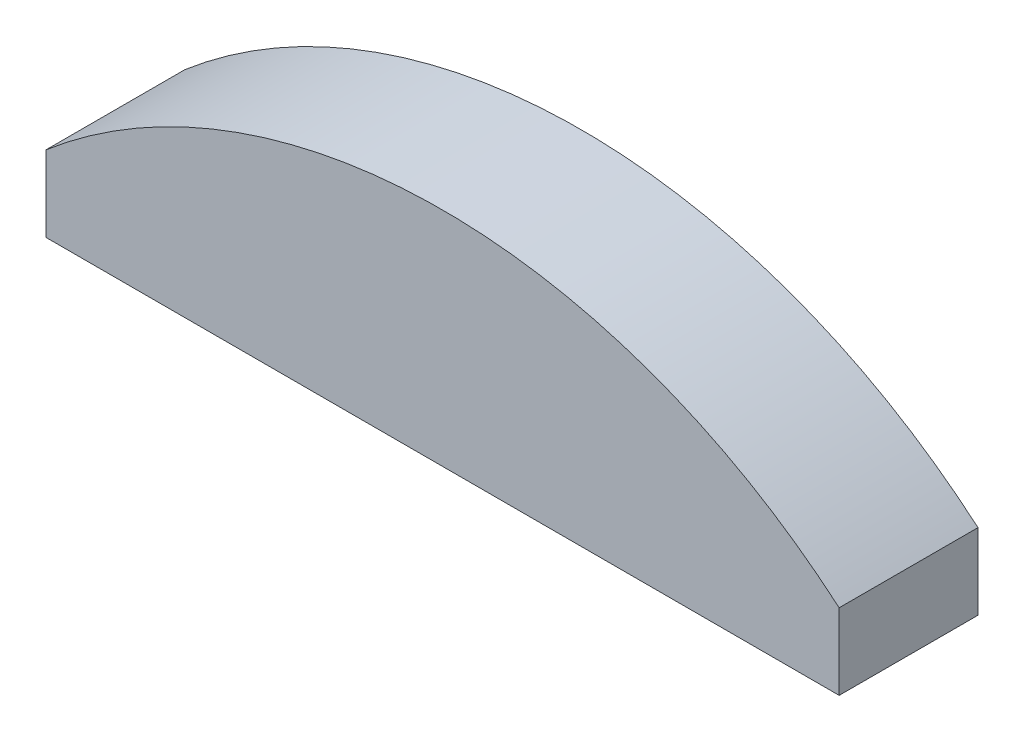
ISO-10303-21;
HEADER;
FILE_DESCRIPTION(('STEP AP214'),'2;1');
FILE_NAME('part.step','',(''),(''),'','','');
FILE_SCHEMA(('AUTOMOTIVE_DESIGN { 1 0 10303 214 1 1 1 1 }'));
ENDSEC;
DATA;
#1=APPLICATION_CONTEXT('core data for automotive mechanical design processes');
#2=APPLICATION_PROTOCOL_DEFINITION('international standard','automotive_design',2000,#1);
#3=PRODUCT_CONTEXT('',#1,'mechanical');
#4=PRODUCT('Part','Part','',(#3));
#5=PRODUCT_RELATED_PRODUCT_CATEGORY('part','',(#4));
#6=PRODUCT_DEFINITION_FORMATION('','',#4);
#7=PRODUCT_DEFINITION_CONTEXT('part definition',#1,'design');
#8=PRODUCT_DEFINITION('design','',#6,#7);
#9=PRODUCT_DEFINITION_SHAPE('','',#8);
#10=(LENGTH_UNIT() NAMED_UNIT(*) SI_UNIT(.MILLI.,.METRE.));
#11=(NAMED_UNIT(*) PLANE_ANGLE_UNIT() SI_UNIT($,.RADIAN.));
#12=(NAMED_UNIT(*) SI_UNIT($,.STERADIAN.) SOLID_ANGLE_UNIT());
#13=UNCERTAINTY_MEASURE_WITH_UNIT(LENGTH_MEASURE(1.E-05),#10,'distance_accuracy_value','');
#14=(GEOMETRIC_REPRESENTATION_CONTEXT(3) GLOBAL_UNCERTAINTY_ASSIGNED_CONTEXT((#13)) GLOBAL_UNIT_ASSIGNED_CONTEXT((#10,
#11,#12)) REPRESENTATION_CONTEXT('',''));
#15=CARTESIAN_POINT('',(0.,0.,0.));
#16=DIRECTION('',(0.,0.,1.));
#17=DIRECTION('',(1.,0.,0.));
#18=AXIS2_PLACEMENT_3D('',#15,#16,#17);
#19=CARTESIAN_POINT('',(-28.5657137141714,28.,5.));
#20=DIRECTION('',(1.,0.,0.));
#21=DIRECTION('',(0.,0.,-1.));
#22=AXIS2_PLACEMENT_3D('',#19,#20,#21);
#23=PLANE('',#22);
#24=DIRECTION('',(0.,-1.,0.));
#25=VECTOR('',#24,1.);
#26=CARTESIAN_POINT('',(-28.5657137141714,28.,-5.));
#27=LINE('',#26,#25);
#28=CARTESIAN_POINT('',(-28.5657137141714,33.4663973584559,-5.));
#29=VERTEX_POINT('',#28);
#30=CARTESIAN_POINT('',(-28.5657137141714,28.,-5.));
#31=VERTEX_POINT('',#30);
#32=EDGE_CURVE('E107',#29,#31,#27,.T.);
#33=ORIENTED_EDGE('',*,*,#32,.T.);
#34=DIRECTION('',(0.,0.,-1.));
#35=VECTOR('',#34,1.);
#36=CARTESIAN_POINT('',(-28.5657137141714,28.,5.));
#37=LINE('',#36,#35);
#38=CARTESIAN_POINT('',(-28.5657137141714,28.,5.));
#39=VERTEX_POINT('',#38);
#40=EDGE_CURVE('E11',#39,#31,#37,.T.);
#41=ORIENTED_EDGE('',*,*,#40,.F.);
#42=DIRECTION('',(0.,-1.,0.));
#43=VECTOR('',#42,1.);
#44=CARTESIAN_POINT('',(-28.5657137141714,28.,5.));
#45=LINE('',#44,#43);
#46=CARTESIAN_POINT('',(-28.5657137141714,33.4663973584559,5.));
#47=VERTEX_POINT('',#46);
#48=EDGE_CURVE('E91',#47,#39,#45,.T.);
#49=ORIENTED_EDGE('',*,*,#48,.F.);
#50=DIRECTION('',(0.,0.,-1.));
#51=VECTOR('',#50,1.);
#52=CARTESIAN_POINT('',(-28.5657137141714,33.4663973584559,5.));
#53=LINE('',#52,#51);
#54=EDGE_CURVE('E103',#47,#29,#53,.T.);
#55=ORIENTED_EDGE('',*,*,#54,.T.);
#56=EDGE_LOOP('',(#33,#41,#49,#55));
#57=FACE_BOUND('',#56,.T.);
#58=ADVANCED_FACE('F39',(#57),#23,.F.);
#59=CARTESIAN_POINT('',(-28.5657137141714,28.,5.));
#60=DIRECTION('',(0.,1.,0.));
#61=DIRECTION('',(0.,0.,1.));
#62=AXIS2_PLACEMENT_3D('',#59,#60,#61);
#63=PLANE('',#62);
#64=DIRECTION('',(1.,0.,0.));
#65=VECTOR('',#64,1.);
#66=CARTESIAN_POINT('',(-28.5657137141714,28.,-5.));
#67=LINE('',#66,#65);
#68=CARTESIAN_POINT('',(28.5657137141714,28.,-5.));
#69=VERTEX_POINT('',#68);
#70=EDGE_CURVE('E96',#31,#69,#67,.T.);
#71=ORIENTED_EDGE('',*,*,#70,.T.);
#72=DIRECTION('',(0.,0.,-1.));
#73=VECTOR('',#72,1.);
#74=CARTESIAN_POINT('',(28.5657137141714,28.,5.));
#75=LINE('',#74,#73);
#76=CARTESIAN_POINT('',(28.5657137141714,28.,5.));
#77=VERTEX_POINT('',#76);
#78=EDGE_CURVE('E48',#77,#69,#75,.T.);
#79=ORIENTED_EDGE('',*,*,#78,.F.);
#80=DIRECTION('',(1.,0.,0.));
#81=VECTOR('',#80,1.);
#82=CARTESIAN_POINT('',(-28.5657137141714,28.,5.));
#83=LINE('',#82,#81);
#84=EDGE_CURVE('E86',#39,#77,#83,.T.);
#85=ORIENTED_EDGE('',*,*,#84,.F.);
#86=ORIENTED_EDGE('',*,*,#40,.T.);
#87=EDGE_LOOP('',(#71,#79,#85,#86));
#88=FACE_BOUND('',#87,.T.);
#89=ADVANCED_FACE('F95',(#88),#63,.F.);
#90=CARTESIAN_POINT('',(28.5657137141714,28.,5.));
#91=DIRECTION('',(-1.,0.,0.));
#92=DIRECTION('',(0.,0.,1.));
#93=AXIS2_PLACEMENT_3D('',#90,#91,#92);
#94=PLANE('',#93);
#95=DIRECTION('',(0.,1.,0.));
#96=VECTOR('',#95,1.);
#97=CARTESIAN_POINT('',(28.5657137141714,28.,-5.));
#98=LINE('',#97,#96);
#99=CARTESIAN_POINT('',(28.5657137141714,33.4663973584559,-5.));
#100=VERTEX_POINT('',#99);
#101=EDGE_CURVE('E73',#69,#100,#98,.T.);
#102=ORIENTED_EDGE('',*,*,#101,.T.);
#103=DIRECTION('',(0.,0.,-1.));
#104=VECTOR('',#103,1.);
#105=CARTESIAN_POINT('',(28.5657137141714,33.4663973584559,5.));
#106=LINE('',#105,#104);
#107=CARTESIAN_POINT('',(28.5657137141714,33.4663973584559,5.));
#108=VERTEX_POINT('',#107);
#109=EDGE_CURVE('E98',#108,#100,#106,.T.);
#110=ORIENTED_EDGE('',*,*,#109,.F.);
#111=DIRECTION('',(0.,1.,0.));
#112=VECTOR('',#111,1.);
#113=CARTESIAN_POINT('',(28.5657137141714,28.,5.));
#114=LINE('',#113,#112);
#115=EDGE_CURVE('E89',#77,#108,#114,.T.);
#116=ORIENTED_EDGE('',*,*,#115,.F.);
#117=ORIENTED_EDGE('',*,*,#78,.T.);
#118=EDGE_LOOP('',(#102,#110,#116,#117));
#119=FACE_BOUND('',#118,.T.);
#120=ADVANCED_FACE('F99',(#119),#94,.F.);
#121=CARTESIAN_POINT('',(0.,0.,5.));
#122=DIRECTION('',(0.,0.,-1.));
#123=DIRECTION('',(-1.,0.,0.));
#124=AXIS2_PLACEMENT_3D('',#121,#122,#123);
#125=CYLINDRICAL_SURFACE('',#124,43.9999971835688);
#126=CARTESIAN_POINT('',(0.,0.,-5.));
#127=DIRECTION('',(0.,0.,1.));
#128=DIRECTION('',(1.,0.,0.));
#129=AXIS2_PLACEMENT_3D('',#126,#127,#128);
#130=CIRCLE('',#129,43.9999971835688);
#131=EDGE_CURVE('E79',#100,#29,#130,.T.);
#132=ORIENTED_EDGE('',*,*,#131,.T.);
#133=ORIENTED_EDGE('',*,*,#54,.F.);
#134=CARTESIAN_POINT('',(0.,0.,5.));
#135=DIRECTION('',(0.,0.,1.));
#136=DIRECTION('',(1.,0.,0.));
#137=AXIS2_PLACEMENT_3D('',#134,#135,#136);
#138=CIRCLE('',#137,43.9999971835688);
#139=EDGE_CURVE('E56',#108,#47,#138,.T.);
#140=ORIENTED_EDGE('',*,*,#139,.F.);
#141=ORIENTED_EDGE('',*,*,#109,.T.);
#142=EDGE_LOOP('',(#132,#133,#140,#141));
#143=FACE_BOUND('',#142,.T.);
#144=ADVANCED_FACE('F120',(#143),#125,.T.);
#145=CARTESIAN_POINT('',(0.,0.,5.));
#146=DIRECTION('',(0.,0.,1.));
#147=DIRECTION('',(1.,0.,0.));
#148=AXIS2_PLACEMENT_3D('',#145,#146,#147);
#149=PLANE('',#148);
#150=ORIENTED_EDGE('',*,*,#48,.T.);
#151=ORIENTED_EDGE('',*,*,#84,.T.);
#152=ORIENTED_EDGE('',*,*,#115,.T.);
#153=ORIENTED_EDGE('',*,*,#139,.T.);
#154=EDGE_LOOP('',(#150,#151,#152,#153));
#155=FACE_BOUND('',#154,.T.);
#156=ADVANCED_FACE('F87',(#155),#149,.T.);
#157=CARTESIAN_POINT('',(0.,0.,-5.));
#158=DIRECTION('',(0.,0.,1.));
#159=DIRECTION('',(1.,0.,0.));
#160=AXIS2_PLACEMENT_3D('',#157,#158,#159);
#161=PLANE('',#160);
#162=ORIENTED_EDGE('',*,*,#32,.F.);
#163=ORIENTED_EDGE('',*,*,#131,.F.);
#164=ORIENTED_EDGE('',*,*,#101,.F.);
#165=ORIENTED_EDGE('',*,*,#70,.F.);
#166=EDGE_LOOP('',(#162,#163,#164,#165));
#167=FACE_BOUND('',#166,.T.);
#168=ADVANCED_FACE('F123',(#167),#161,.F.);
#169=CLOSED_SHELL('',(#58,#89,#120,#144,#156,#168));
#170=MANIFOLD_SOLID_BREP('B2',#169);
#171=ADVANCED_BREP_SHAPE_REPRESENTATION('',(#18,#170),#14);
#172=SHAPE_DEFINITION_REPRESENTATION(#9,#171);
ENDSEC;
END-ISO-10303-21;
